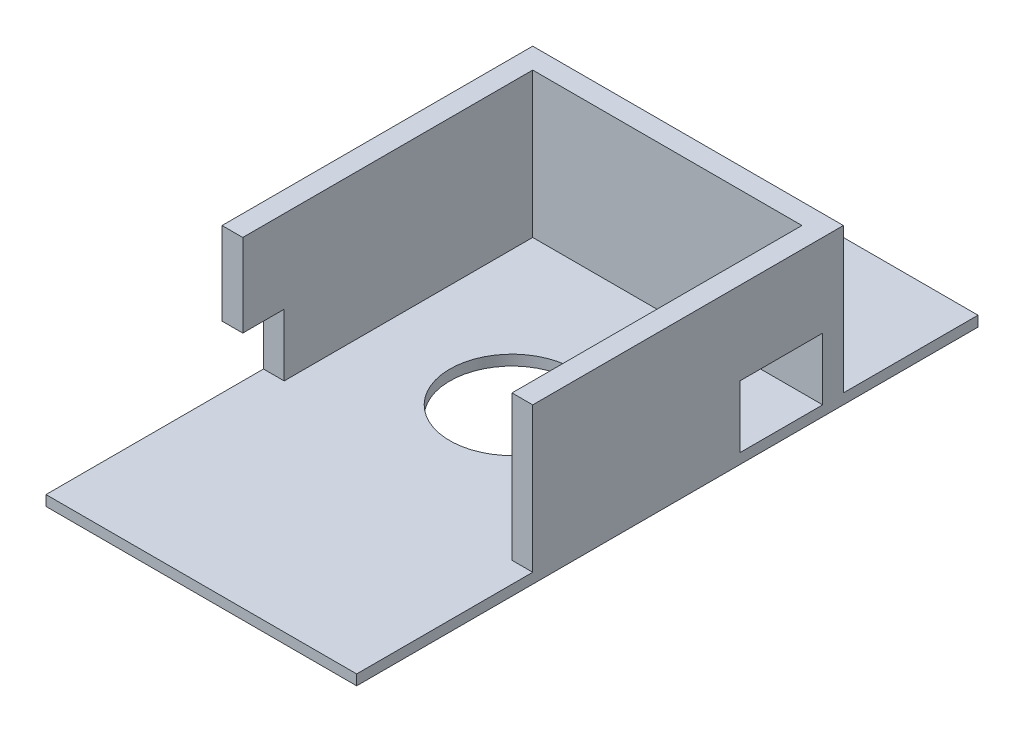
ISO-10303-21;
HEADER;
FILE_DESCRIPTION(('STEP AP214'),'2;1');
FILE_NAME('part.step','',(''),(''),'','','');
FILE_SCHEMA(('AUTOMOTIVE_DESIGN { 1 0 10303 214 1 1 1 1 }'));
ENDSEC;
DATA;
#1=APPLICATION_CONTEXT('core data for automotive mechanical design processes');
#2=APPLICATION_PROTOCOL_DEFINITION('international standard','automotive_design',2000,#1);
#3=PRODUCT_CONTEXT('',#1,'mechanical');
#4=PRODUCT('Part','Part','',(#3));
#5=PRODUCT_RELATED_PRODUCT_CATEGORY('part','',(#4));
#6=PRODUCT_DEFINITION_FORMATION('','',#4);
#7=PRODUCT_DEFINITION_CONTEXT('part definition',#1,'design');
#8=PRODUCT_DEFINITION('design','',#6,#7);
#9=PRODUCT_DEFINITION_SHAPE('','',#8);
#10=(LENGTH_UNIT() NAMED_UNIT(*) SI_UNIT(.MILLI.,.METRE.));
#11=(NAMED_UNIT(*) PLANE_ANGLE_UNIT() SI_UNIT($,.RADIAN.));
#12=(NAMED_UNIT(*) SI_UNIT($,.STERADIAN.) SOLID_ANGLE_UNIT());
#13=UNCERTAINTY_MEASURE_WITH_UNIT(LENGTH_MEASURE(1.E-05),#10,'distance_accuracy_value','');
#14=(GEOMETRIC_REPRESENTATION_CONTEXT(3) GLOBAL_UNCERTAINTY_ASSIGNED_CONTEXT((#13)) GLOBAL_UNIT_ASSIGNED_CONTEXT((#10,
#11,#12)) REPRESENTATION_CONTEXT('',''));
#15=CARTESIAN_POINT('',(0.,0.,0.));
#16=DIRECTION('',(0.,0.,1.));
#17=DIRECTION('',(1.,0.,0.));
#18=AXIS2_PLACEMENT_3D('',#15,#16,#17);
#19=CARTESIAN_POINT('',(0.,35.,0.));
#20=DIRECTION('',(0.,1.,0.));
#21=DIRECTION('',(0.,0.,1.));
#22=AXIS2_PLACEMENT_3D('',#19,#20,#21);
#23=PLANE('',#22);
#24=DIRECTION('',(0.,0.,1.));
#25=VECTOR('',#24,1.);
#26=CARTESIAN_POINT('',(-33.1781376518219,35.,-22.4898785425101));
#27=LINE('',#26,#25);
#28=CARTESIAN_POINT('',(-33.1781376518219,35.,-22.4898785425101));
#29=VERTEX_POINT('',#28);
#30=CARTESIAN_POINT('',(-33.1781376518219,35.,52.5101214574899));
#31=VERTEX_POINT('',#30);
#32=EDGE_CURVE('E319',#29,#31,#27,.T.);
#33=ORIENTED_EDGE('',*,*,#32,.T.);
#34=DIRECTION('',(-1.,0.,0.));
#35=VECTOR('',#34,1.);
#36=CARTESIAN_POINT('',(-33.1781376518219,35.,52.5101214574899));
#37=LINE('',#36,#35);
#38=CARTESIAN_POINT('',(-28.1781376518219,35.,52.5101214574899));
#39=VERTEX_POINT('',#38);
#40=EDGE_CURVE('E246',#39,#31,#37,.T.);
#41=ORIENTED_EDGE('',*,*,#40,.F.);
#42=DIRECTION('',(0.,0.,1.));
#43=VECTOR('',#42,1.);
#44=CARTESIAN_POINT('',(-28.1781376518219,35.,-17.4898785425101));
#45=LINE('',#44,#43);
#46=CARTESIAN_POINT('',(-28.1781376518219,35.,-17.4898785425101));
#47=VERTEX_POINT('',#46);
#48=EDGE_CURVE('E302',#47,#39,#45,.T.);
#49=ORIENTED_EDGE('',*,*,#48,.F.);
#50=DIRECTION('',(-1.,0.,0.));
#51=VECTOR('',#50,1.);
#52=CARTESIAN_POINT('',(-28.1781376518219,35.,-17.4898785425101));
#53=LINE('',#52,#51);
#54=CARTESIAN_POINT('',(36.8218623481781,35.,-17.4898785425101));
#55=VERTEX_POINT('',#54);
#56=EDGE_CURVE('E310',#55,#47,#53,.T.);
#57=ORIENTED_EDGE('',*,*,#56,.F.);
#58=DIRECTION('',(0.,0.,-1.));
#59=VECTOR('',#58,1.);
#60=CARTESIAN_POINT('',(36.8218623481781,35.,-17.4898785425101));
#61=LINE('',#60,#59);
#62=CARTESIAN_POINT('',(36.8218623481781,35.,52.5101214574899));
#63=VERTEX_POINT('',#62);
#64=EDGE_CURVE('E306',#63,#55,#61,.T.);
#65=ORIENTED_EDGE('',*,*,#64,.F.);
#66=CARTESIAN_POINT('',(41.8218623481781,35.,52.5101214574899));
#67=VERTEX_POINT('',#66);
#68=EDGE_CURVE('E247',#67,#63,#37,.T.);
#69=ORIENTED_EDGE('',*,*,#68,.F.);
#70=DIRECTION('',(0.,0.,-1.));
#71=VECTOR('',#70,1.);
#72=CARTESIAN_POINT('',(41.8218623481781,35.,-22.4898785425101));
#73=LINE('',#72,#71);
#74=CARTESIAN_POINT('',(41.8218623481781,35.,-22.4898785425101));
#75=VERTEX_POINT('',#74);
#76=EDGE_CURVE('E322',#67,#75,#73,.T.);
#77=ORIENTED_EDGE('',*,*,#76,.T.);
#78=DIRECTION('',(-1.,0.,0.));
#79=VECTOR('',#78,1.);
#80=CARTESIAN_POINT('',(-33.1781376518219,35.,-22.4898785425101));
#81=LINE('',#80,#79);
#82=EDGE_CURVE('E68',#75,#29,#81,.T.);
#83=ORIENTED_EDGE('',*,*,#82,.T.);
#84=EDGE_LOOP('',(#33,#41,#49,#57,#65,#69,#77,#83));
#85=FACE_BOUND('',#84,.T.);
#86=ADVANCED_FACE('F44',(#85),#23,.T.);
#87=CARTESIAN_POINT('',(-33.1781376518219,35.,-22.4898785425101));
#88=DIRECTION('',(1.,0.,0.));
#89=DIRECTION('',(0.,0.,-1.));
#90=AXIS2_PLACEMENT_3D('',#87,#88,#89);
#91=PLANE('',#90);
#92=DIRECTION('',(0.,0.,-1.));
#93=VECTOR('',#92,1.);
#94=CARTESIAN_POINT('',(-33.1781376518219,0.,95.0101214574899));
#95=LINE('',#94,#93);
#96=CARTESIAN_POINT('',(-33.1781376518219,0.,95.0101214574899));
#97=VERTEX_POINT('',#96);
#98=CARTESIAN_POINT('',(-33.1781376518219,0.,42.5101214574899));
#99=VERTEX_POINT('',#98);
#100=EDGE_CURVE('E273',#97,#99,#95,.T.);
#101=ORIENTED_EDGE('',*,*,#100,.T.);
#102=DIRECTION('',(0.,-1.,0.));
#103=VECTOR('',#102,1.);
#104=CARTESIAN_POINT('',(-33.1781376518219,0.,42.5101214574899));
#105=LINE('',#104,#103);
#106=CARTESIAN_POINT('',(-33.1781376518219,15.,42.5101214574899));
#107=VERTEX_POINT('',#106);
#108=EDGE_CURVE('E220',#107,#99,#105,.T.);
#109=ORIENTED_EDGE('',*,*,#108,.F.);
#110=DIRECTION('',(0.,0.,-1.));
#111=VECTOR('',#110,1.);
#112=CARTESIAN_POINT('',(-33.1781376518219,15.,62.5101214574899));
#113=LINE('',#112,#111);
#114=CARTESIAN_POINT('',(-33.1781376518219,15.,52.5101214574899));
#115=VERTEX_POINT('',#114);
#116=EDGE_CURVE('E216',#115,#107,#113,.T.);
#117=ORIENTED_EDGE('',*,*,#116,.F.);
#118=DIRECTION('',(0.,-1.,0.));
#119=VECTOR('',#118,1.);
#120=CARTESIAN_POINT('',(-33.1781376518219,35.,52.5101214574899));
#121=LINE('',#120,#119);
#122=EDGE_CURVE('E239',#31,#115,#121,.T.);
#123=ORIENTED_EDGE('',*,*,#122,.F.);
#124=ORIENTED_EDGE('',*,*,#32,.F.);
#125=DIRECTION('',(0.,-1.,0.));
#126=VECTOR('',#125,1.);
#127=CARTESIAN_POINT('',(-33.1781376518219,35.,-22.4898785425101));
#128=LINE('',#127,#126);
#129=CARTESIAN_POINT('',(-33.1781376518219,0.,-22.4898785425101));
#130=VERTEX_POINT('',#129);
#131=EDGE_CURVE('E327',#29,#130,#128,.T.);
#132=ORIENTED_EDGE('',*,*,#131,.T.);
#133=CARTESIAN_POINT('',(-33.1781376518218,0.,-54.9898785425101));
#134=VERTEX_POINT('',#133);
#135=EDGE_CURVE('E277',#130,#134,#95,.T.);
#136=ORIENTED_EDGE('',*,*,#135,.T.);
#137=DIRECTION('',(0.,1.,0.));
#138=VECTOR('',#137,1.);
#139=CARTESIAN_POINT('',(-33.1781376518218,-2.5,-54.9898785425101));
#140=LINE('',#139,#138);
#141=CARTESIAN_POINT('',(-33.1781376518218,-2.5,-54.9898785425101));
#142=VERTEX_POINT('',#141);
#143=EDGE_CURVE('E298',#142,#134,#140,.T.);
#144=ORIENTED_EDGE('',*,*,#143,.F.);
#145=DIRECTION('',(0.,0.,-1.));
#146=VECTOR('',#145,1.);
#147=CARTESIAN_POINT('',(-33.1781376518219,-2.5,95.0101214574899));
#148=LINE('',#147,#146);
#149=CARTESIAN_POINT('',(-33.1781376518219,-2.5,95.0101214574899));
#150=VERTEX_POINT('',#149);
#151=EDGE_CURVE('E258',#150,#142,#148,.T.);
#152=ORIENTED_EDGE('',*,*,#151,.F.);
#153=DIRECTION('',(0.,1.,0.));
#154=VECTOR('',#153,1.);
#155=CARTESIAN_POINT('',(-33.1781376518219,-2.5,95.0101214574899));
#156=LINE('',#155,#154);
#157=EDGE_CURVE('E272',#150,#97,#156,.T.);
#158=ORIENTED_EDGE('',*,*,#157,.T.);
#159=EDGE_LOOP('',(#101,#109,#117,#123,#124,#132,#136,#144,#152,#158));
#160=FACE_BOUND('',#159,.T.);
#161=ADVANCED_FACE('F46',(#160),#91,.F.);
#162=CARTESIAN_POINT('',(41.8218623481781,35.,-22.4898785425101));
#163=DIRECTION('',(-1.,0.,0.));
#164=DIRECTION('',(0.,0.,1.));
#165=AXIS2_PLACEMENT_3D('',#162,#163,#164);
#166=PLANE('',#165);
#167=DIRECTION('',(0.,0.,-1.));
#168=VECTOR('',#167,1.);
#169=CARTESIAN_POINT('',(41.8218623481781,0.,2.51012145748987));
#170=LINE('',#169,#168);
#171=CARTESIAN_POINT('',(41.8218623481781,0.,2.51012145748987));
#172=VERTEX_POINT('',#171);
#173=CARTESIAN_POINT('',(41.8218623481781,0.,-17.4898785425101));
#174=VERTEX_POINT('',#173);
#175=EDGE_CURVE('E182',#172,#174,#170,.T.);
#176=ORIENTED_EDGE('',*,*,#175,.F.);
#177=DIRECTION('',(0.,-1.,0.));
#178=VECTOR('',#177,1.);
#179=CARTESIAN_POINT('',(41.8218623481781,15.,2.51012145748988));
#180=LINE('',#179,#178);
#181=CARTESIAN_POINT('',(41.8218623481781,15.,2.51012145748988));
#182=VERTEX_POINT('',#181);
#183=EDGE_CURVE('E60',#182,#172,#180,.T.);
#184=ORIENTED_EDGE('',*,*,#183,.F.);
#185=DIRECTION('',(0.,0.,1.));
#186=VECTOR('',#185,1.);
#187=CARTESIAN_POINT('',(41.8218623481781,15.,2.51012145748988));
#188=LINE('',#187,#186);
#189=CARTESIAN_POINT('',(41.8218623481781,15.,-17.4898785425101));
#190=VERTEX_POINT('',#189);
#191=EDGE_CURVE('E193',#190,#182,#188,.T.);
#192=ORIENTED_EDGE('',*,*,#191,.F.);
#193=DIRECTION('',(0.,1.,0.));
#194=VECTOR('',#193,1.);
#195=CARTESIAN_POINT('',(41.8218623481781,15.,-17.4898785425101));
#196=LINE('',#195,#194);
#197=EDGE_CURVE('E170',#174,#190,#196,.T.);
#198=ORIENTED_EDGE('',*,*,#197,.F.);
#199=EDGE_LOOP('',(#176,#184,#192,#198));
#200=FACE_BOUND('',#199,.T.);
#201=DIRECTION('',(0.,1.,0.));
#202=VECTOR('',#201,1.);
#203=CARTESIAN_POINT('',(41.8218623481781,35.,52.5101214574899));
#204=LINE('',#203,#202);
#205=CARTESIAN_POINT('',(41.8218623481781,0.,52.5101214574899));
#206=VERTEX_POINT('',#205);
#207=EDGE_CURVE('E243',#206,#67,#204,.T.);
#208=ORIENTED_EDGE('',*,*,#207,.F.);
#209=DIRECTION('',(0.,0.,1.));
#210=VECTOR('',#209,1.);
#211=CARTESIAN_POINT('',(41.8218623481781,0.,95.0101214574899));
#212=LINE('',#211,#210);
#213=CARTESIAN_POINT('',(41.8218623481781,0.,95.0101214574899));
#214=VERTEX_POINT('',#213);
#215=EDGE_CURVE('E280',#206,#214,#212,.T.);
#216=ORIENTED_EDGE('',*,*,#215,.T.);
#217=DIRECTION('',(0.,1.,0.));
#218=VECTOR('',#217,1.);
#219=CARTESIAN_POINT('',(41.8218623481781,-2.5,95.0101214574899));
#220=LINE('',#219,#218);
#221=CARTESIAN_POINT('',(41.8218623481781,-2.5,95.0101214574899));
#222=VERTEX_POINT('',#221);
#223=EDGE_CURVE('E290',#222,#214,#220,.T.);
#224=ORIENTED_EDGE('',*,*,#223,.F.);
#225=DIRECTION('',(0.,0.,1.));
#226=VECTOR('',#225,1.);
#227=CARTESIAN_POINT('',(41.8218623481781,-2.5,95.0101214574899));
#228=LINE('',#227,#226);
#229=CARTESIAN_POINT('',(41.8218623481781,-2.5,-54.9898785425101));
#230=VERTEX_POINT('',#229);
#231=EDGE_CURVE('E266',#230,#222,#228,.T.);
#232=ORIENTED_EDGE('',*,*,#231,.F.);
#233=DIRECTION('',(0.,1.,0.));
#234=VECTOR('',#233,1.);
#235=CARTESIAN_POINT('',(41.8218623481781,-2.5,-54.9898785425101));
#236=LINE('',#235,#234);
#237=CARTESIAN_POINT('',(41.8218623481781,0.,-54.9898785425101));
#238=VERTEX_POINT('',#237);
#239=EDGE_CURVE('E294',#230,#238,#236,.T.);
#240=ORIENTED_EDGE('',*,*,#239,.T.);
#241=CARTESIAN_POINT('',(41.8218623481781,0.,-22.4898785425101));
#242=VERTEX_POINT('',#241);
#243=EDGE_CURVE('E281',#238,#242,#212,.T.);
#244=ORIENTED_EDGE('',*,*,#243,.T.);
#245=DIRECTION('',(0.,-1.,0.));
#246=VECTOR('',#245,1.);
#247=CARTESIAN_POINT('',(41.8218623481781,35.,-22.4898785425101));
#248=LINE('',#247,#246);
#249=EDGE_CURVE('E334',#75,#242,#248,.T.);
#250=ORIENTED_EDGE('',*,*,#249,.F.);
#251=ORIENTED_EDGE('',*,*,#76,.F.);
#252=EDGE_LOOP('',(#208,#216,#224,#232,#240,#244,#250,#251));
#253=FACE_BOUND('',#252,.T.);
#254=ADVANCED_FACE('F190',(#200,#253),#166,.F.);
#255=CARTESIAN_POINT('',(-33.1781376518219,35.,-22.4898785425101));
#256=DIRECTION('',(0.,0.,1.));
#257=DIRECTION('',(1.,0.,0.));
#258=AXIS2_PLACEMENT_3D('',#255,#256,#257);
#259=PLANE('',#258);
#260=DIRECTION('',(-1.,0.,0.));
#261=VECTOR('',#260,1.);
#262=CARTESIAN_POINT('',(-33.1781376518219,0.,-22.4898785425101));
#263=LINE('',#262,#261);
#264=EDGE_CURVE('E316',#242,#130,#263,.T.);
#265=ORIENTED_EDGE('',*,*,#264,.T.);
#266=ORIENTED_EDGE('',*,*,#131,.F.);
#267=ORIENTED_EDGE('',*,*,#82,.F.);
#268=ORIENTED_EDGE('',*,*,#249,.T.);
#269=EDGE_LOOP('',(#265,#266,#267,#268));
#270=FACE_BOUND('',#269,.T.);
#271=ADVANCED_FACE('F388',(#270),#259,.F.);
#272=CARTESIAN_POINT('',(-28.1781376518219,-5.,-17.4898785425101));
#273=DIRECTION('',(-1.,0.,0.));
#274=DIRECTION('',(0.,0.,1.));
#275=AXIS2_PLACEMENT_3D('',#272,#273,#274);
#276=PLANE('',#275);
#277=DIRECTION('',(0.,0.,-1.));
#278=VECTOR('',#277,1.);
#279=CARTESIAN_POINT('',(-28.1781376518219,15.,-17.4898785425101));
#280=LINE('',#279,#278);
#281=CARTESIAN_POINT('',(-28.1781376518219,15.,52.5101214574899));
#282=VERTEX_POINT('',#281);
#283=CARTESIAN_POINT('',(-28.1781376518219,15.,42.5101214574899));
#284=VERTEX_POINT('',#283);
#285=EDGE_CURVE('E229',#282,#284,#280,.T.);
#286=ORIENTED_EDGE('',*,*,#285,.T.);
#287=DIRECTION('',(0.,-1.,0.));
#288=VECTOR('',#287,1.);
#289=CARTESIAN_POINT('',(-28.1781376518219,-5.,42.5101214574899));
#290=LINE('',#289,#288);
#291=CARTESIAN_POINT('',(-28.1781376518219,0.,42.5101214574899));
#292=VERTEX_POINT('',#291);
#293=EDGE_CURVE('E235',#284,#292,#290,.T.);
#294=ORIENTED_EDGE('',*,*,#293,.T.);
#295=DIRECTION('',(0.,0.,1.));
#296=VECTOR('',#295,1.);
#297=CARTESIAN_POINT('',(-28.1781376518219,0.,0.));
#298=LINE('',#297,#296);
#299=CARTESIAN_POINT('',(-28.1781376518219,0.,-17.4898785425101));
#300=VERTEX_POINT('',#299);
#301=EDGE_CURVE('E178',#300,#292,#298,.T.);
#302=ORIENTED_EDGE('',*,*,#301,.F.);
#303=DIRECTION('',(0.,1.,0.));
#304=VECTOR('',#303,1.);
#305=CARTESIAN_POINT('',(-28.1781376518219,-5.,-17.4898785425101));
#306=LINE('',#305,#304);
#307=EDGE_CURVE('E173',#300,#47,#306,.T.);
#308=ORIENTED_EDGE('',*,*,#307,.T.);
#309=ORIENTED_EDGE('',*,*,#48,.T.);
#310=DIRECTION('',(0.,1.,0.));
#311=VECTOR('',#310,1.);
#312=CARTESIAN_POINT('',(-28.1781376518219,-5.,52.5101214574899));
#313=LINE('',#312,#311);
#314=EDGE_CURVE('E250',#282,#39,#313,.T.);
#315=ORIENTED_EDGE('',*,*,#314,.F.);
#316=EDGE_LOOP('',(#286,#294,#302,#308,#309,#315));
#317=FACE_BOUND('',#316,.T.);
#318=ADVANCED_FACE('F396',(#317),#276,.F.);
#319=CARTESIAN_POINT('',(-28.1781376518219,-5.,-17.4898785425101));
#320=DIRECTION('',(0.,0.,-1.));
#321=DIRECTION('',(-1.,0.,0.));
#322=AXIS2_PLACEMENT_3D('',#319,#320,#321);
#323=PLANE('',#322);
#324=DIRECTION('',(1.,0.,0.));
#325=VECTOR('',#324,1.);
#326=CARTESIAN_POINT('',(31.8218623481781,15.,-17.4898785425101));
#327=LINE('',#326,#325);
#328=CARTESIAN_POINT('',(36.8218623481781,15.,-17.4898785425101));
#329=VERTEX_POINT('',#328);
#330=EDGE_CURVE('E204',#329,#190,#327,.T.);
#331=ORIENTED_EDGE('',*,*,#330,.F.);
#332=DIRECTION('',(0.,1.,0.));
#333=VECTOR('',#332,1.);
#334=CARTESIAN_POINT('',(36.8218623481781,-5.,-17.4898785425101));
#335=LINE('',#334,#333);
#336=EDGE_CURVE('E313',#329,#55,#335,.T.);
#337=ORIENTED_EDGE('',*,*,#336,.T.);
#338=ORIENTED_EDGE('',*,*,#56,.T.);
#339=ORIENTED_EDGE('',*,*,#307,.F.);
#340=DIRECTION('',(-1.,0.,0.));
#341=VECTOR('',#340,1.);
#342=CARTESIAN_POINT('',(0.,0.,-17.4898785425101));
#343=LINE('',#342,#341);
#344=EDGE_CURVE('E165',#174,#300,#343,.T.);
#345=ORIENTED_EDGE('',*,*,#344,.F.);
#346=ORIENTED_EDGE('',*,*,#197,.T.);
#347=EDGE_LOOP('',(#331,#337,#338,#339,#345,#346));
#348=FACE_BOUND('',#347,.T.);
#349=ADVANCED_FACE('F168',(#348),#323,.F.);
#350=CARTESIAN_POINT('',(36.8218623481781,-5.,-17.4898785425101));
#351=DIRECTION('',(1.,0.,0.));
#352=DIRECTION('',(0.,0.,-1.));
#353=AXIS2_PLACEMENT_3D('',#350,#351,#352);
#354=PLANE('',#353);
#355=DIRECTION('',(0.,0.,1.));
#356=VECTOR('',#355,1.);
#357=CARTESIAN_POINT('',(36.8218623481781,15.,-17.4898785425101));
#358=LINE('',#357,#356);
#359=CARTESIAN_POINT('',(36.8218623481781,15.,2.51012145748988));
#360=VERTEX_POINT('',#359);
#361=EDGE_CURVE('E11',#329,#360,#358,.T.);
#362=ORIENTED_EDGE('',*,*,#361,.T.);
#363=DIRECTION('',(0.,-1.,0.));
#364=VECTOR('',#363,1.);
#365=CARTESIAN_POINT('',(36.8218623481781,-5.,2.51012145748987));
#366=LINE('',#365,#364);
#367=CARTESIAN_POINT('',(36.8218623481782,0.,2.51012145748987));
#368=VERTEX_POINT('',#367);
#369=EDGE_CURVE('E203',#360,#368,#366,.T.);
#370=ORIENTED_EDGE('',*,*,#369,.T.);
#371=DIRECTION('',(0.,0.,-1.));
#372=VECTOR('',#371,1.);
#373=CARTESIAN_POINT('',(36.8218623481781,0.,0.));
#374=LINE('',#373,#372);
#375=CARTESIAN_POINT('',(36.8218623481782,0.,52.5101214574899));
#376=VERTEX_POINT('',#375);
#377=EDGE_CURVE('E179',#376,#368,#374,.T.);
#378=ORIENTED_EDGE('',*,*,#377,.F.);
#379=DIRECTION('',(0.,-1.,0.));
#380=VECTOR('',#379,1.);
#381=CARTESIAN_POINT('',(36.8218623481782,-5.,52.5101214574899));
#382=LINE('',#381,#380);
#383=EDGE_CURVE('E342',#63,#376,#382,.T.);
#384=ORIENTED_EDGE('',*,*,#383,.F.);
#385=ORIENTED_EDGE('',*,*,#64,.T.);
#386=ORIENTED_EDGE('',*,*,#336,.F.);
#387=EDGE_LOOP('',(#362,#370,#378,#384,#385,#386));
#388=FACE_BOUND('',#387,.T.);
#389=ADVANCED_FACE('F423',(#388),#354,.F.);
#390=CARTESIAN_POINT('',(0.,-2.5,0.));
#391=DIRECTION('',(0.,-1.,0.));
#392=DIRECTION('',(0.,0.,-1.));
#393=AXIS2_PLACEMENT_3D('',#390,#391,#392);
#394=PLANE('',#393);
#395=CARTESIAN_POINT('',(4.32186234817812,-2.5,20.0101214574899));
#396=DIRECTION('',(0.,-1.,0.));
#397=DIRECTION('',(0.,0.,-1.));
#398=AXIS2_PLACEMENT_3D('',#395,#396,#397);
#399=CIRCLE('',#398,15.);
#400=CARTESIAN_POINT('',(4.32186234817812,-2.5,5.01012145748987));
#401=VERTEX_POINT('',#400);
#402=EDGE_CURVE('E253',#401,#401,#399,.T.);
#403=ORIENTED_EDGE('',*,*,#402,.F.);
#404=EDGE_LOOP('',(#403));
#405=FACE_BOUND('',#404,.T.);
#406=ORIENTED_EDGE('',*,*,#151,.T.);
#407=DIRECTION('',(1.,0.,0.));
#408=VECTOR('',#407,1.);
#409=CARTESIAN_POINT('',(-33.1781376518218,-2.5,-54.9898785425101));
#410=LINE('',#409,#408);
#411=EDGE_CURVE('E262',#142,#230,#410,.T.);
#412=ORIENTED_EDGE('',*,*,#411,.T.);
#413=ORIENTED_EDGE('',*,*,#231,.T.);
#414=DIRECTION('',(-1.,0.,0.));
#415=VECTOR('',#414,1.);
#416=CARTESIAN_POINT('',(-33.1781376518219,-2.5,95.0101214574899));
#417=LINE('',#416,#415);
#418=EDGE_CURVE('E269',#222,#150,#417,.T.);
#419=ORIENTED_EDGE('',*,*,#418,.T.);
#420=EDGE_LOOP('',(#406,#412,#413,#419));
#421=FACE_BOUND('',#420,.T.);
#422=ADVANCED_FACE('F379',(#405,#421),#394,.T.);
#423=CARTESIAN_POINT('',(-33.1781376518219,-2.5,95.0101214574899));
#424=DIRECTION('',(0.,0.,-1.));
#425=DIRECTION('',(-1.,0.,0.));
#426=AXIS2_PLACEMENT_3D('',#423,#424,#425);
#427=PLANE('',#426);
#428=DIRECTION('',(-1.,0.,0.));
#429=VECTOR('',#428,1.);
#430=CARTESIAN_POINT('',(-33.1781376518219,0.,95.0101214574899));
#431=LINE('',#430,#429);
#432=EDGE_CURVE('E263',#214,#97,#431,.T.);
#433=ORIENTED_EDGE('',*,*,#432,.T.);
#434=ORIENTED_EDGE('',*,*,#157,.F.);
#435=ORIENTED_EDGE('',*,*,#418,.F.);
#436=ORIENTED_EDGE('',*,*,#223,.T.);
#437=EDGE_LOOP('',(#433,#434,#435,#436));
#438=FACE_BOUND('',#437,.T.);
#439=ADVANCED_FACE('F373',(#438),#427,.F.);
#440=CARTESIAN_POINT('',(-33.1781376518218,-2.5,-54.9898785425101));
#441=DIRECTION('',(0.,0.,1.));
#442=DIRECTION('',(1.,0.,0.));
#443=AXIS2_PLACEMENT_3D('',#440,#441,#442);
#444=PLANE('',#443);
#445=DIRECTION('',(1.,0.,0.));
#446=VECTOR('',#445,1.);
#447=CARTESIAN_POINT('',(-33.1781376518218,0.,-54.9898785425101));
#448=LINE('',#447,#446);
#449=EDGE_CURVE('E276',#134,#238,#448,.T.);
#450=ORIENTED_EDGE('',*,*,#449,.T.);
#451=ORIENTED_EDGE('',*,*,#239,.F.);
#452=ORIENTED_EDGE('',*,*,#411,.F.);
#453=ORIENTED_EDGE('',*,*,#143,.T.);
#454=EDGE_LOOP('',(#450,#451,#452,#453));
#455=FACE_BOUND('',#454,.T.);
#456=ADVANCED_FACE('F445',(#455),#444,.F.);
#457=CARTESIAN_POINT('',(0.,0.,0.));
#458=DIRECTION('',(0.,-1.,0.));
#459=DIRECTION('',(0.,0.,-1.));
#460=AXIS2_PLACEMENT_3D('',#457,#458,#459);
#461=PLANE('',#460);
#462=ORIENTED_EDGE('',*,*,#264,.F.);
#463=ORIENTED_EDGE('',*,*,#243,.F.);
#464=ORIENTED_EDGE('',*,*,#449,.F.);
#465=ORIENTED_EDGE('',*,*,#135,.F.);
#466=EDGE_LOOP('',(#462,#463,#464,#465));
#467=FACE_BOUND('',#466,.T.);
#468=ADVANCED_FACE('F386',(#467),#461,.F.);
#469=ORIENTED_EDGE('',*,*,#377,.T.);
#470=DIRECTION('',(1.,0.,0.));
#471=VECTOR('',#470,1.);
#472=CARTESIAN_POINT('',(31.8218623481781,0.,2.51012145748987));
#473=LINE('',#472,#471);
#474=EDGE_CURVE('E186',#368,#172,#473,.T.);
#475=ORIENTED_EDGE('',*,*,#474,.T.);
#476=ORIENTED_EDGE('',*,*,#175,.T.);
#477=ORIENTED_EDGE('',*,*,#344,.T.);
#478=ORIENTED_EDGE('',*,*,#301,.T.);
#479=DIRECTION('',(-1.,0.,0.));
#480=VECTOR('',#479,1.);
#481=CARTESIAN_POINT('',(-23.1781376518219,0.,42.5101214574899));
#482=LINE('',#481,#480);
#483=EDGE_CURVE('E225',#292,#99,#482,.T.);
#484=ORIENTED_EDGE('',*,*,#483,.T.);
#485=ORIENTED_EDGE('',*,*,#100,.F.);
#486=ORIENTED_EDGE('',*,*,#432,.F.);
#487=ORIENTED_EDGE('',*,*,#215,.F.);
#488=DIRECTION('',(-1.,0.,0.));
#489=VECTOR('',#488,1.);
#490=CARTESIAN_POINT('',(41.8218623481781,0.,52.5101214574899));
#491=LINE('',#490,#489);
#492=EDGE_CURVE('E212',#206,#376,#491,.T.);
#493=ORIENTED_EDGE('',*,*,#492,.T.);
#494=EDGE_LOOP('',(#469,#475,#476,#477,#478,#484,#485,#486,#487,#493));
#495=FACE_BOUND('',#494,.T.);
#496=CARTESIAN_POINT('',(4.32186234817812,0.,20.0101214574899));
#497=DIRECTION('',(0.,-1.,0.));
#498=DIRECTION('',(0.,0.,-1.));
#499=AXIS2_PLACEMENT_3D('',#496,#497,#498);
#500=CIRCLE('',#499,15.);
#501=CARTESIAN_POINT('',(4.32186234817812,0.,5.01012145748987));
#502=VERTEX_POINT('',#501);
#503=EDGE_CURVE('E257',#502,#502,#500,.T.);
#504=ORIENTED_EDGE('',*,*,#503,.T.);
#505=EDGE_LOOP('',(#504));
#506=FACE_BOUND('',#505,.T.);
#507=ADVANCED_FACE('F184',(#495,#506),#461,.F.);
#508=CARTESIAN_POINT('',(4.32186234817812,12.5,20.0101214574899));
#509=DIRECTION('',(0.,-1.,0.));
#510=DIRECTION('',(0.,0.,-1.));
#511=AXIS2_PLACEMENT_3D('',#508,#509,#510);
#512=CYLINDRICAL_SURFACE('',#511,15.);
#513=ORIENTED_EDGE('',*,*,#402,.T.);
#514=EDGE_LOOP('',(#513));
#515=FACE_BOUND('',#514,.T.);
#516=ORIENTED_EDGE('',*,*,#503,.F.);
#517=EDGE_LOOP('',(#516));
#518=FACE_BOUND('',#517,.T.);
#519=ADVANCED_FACE('F462',(#515,#518),#512,.F.);
#520=CARTESIAN_POINT('',(0.,0.,52.5101214574899));
#521=DIRECTION('',(0.,0.,1.));
#522=DIRECTION('',(1.,0.,0.));
#523=AXIS2_PLACEMENT_3D('',#520,#521,#522);
#524=PLANE('',#523);
#525=DIRECTION('',(-1.,0.,0.));
#526=VECTOR('',#525,1.);
#527=CARTESIAN_POINT('',(0.,15.,52.5101214574899));
#528=LINE('',#527,#526);
#529=EDGE_CURVE('E53',#282,#115,#528,.T.);
#530=ORIENTED_EDGE('',*,*,#529,.F.);
#531=ORIENTED_EDGE('',*,*,#314,.T.);
#532=ORIENTED_EDGE('',*,*,#40,.T.);
#533=ORIENTED_EDGE('',*,*,#122,.T.);
#534=EDGE_LOOP('',(#530,#531,#532,#533));
#535=FACE_BOUND('',#534,.T.);
#536=ADVANCED_FACE('F359',(#535),#524,.T.);
#537=ORIENTED_EDGE('',*,*,#383,.T.);
#538=ORIENTED_EDGE('',*,*,#492,.F.);
#539=ORIENTED_EDGE('',*,*,#207,.T.);
#540=ORIENTED_EDGE('',*,*,#68,.T.);
#541=EDGE_LOOP('',(#537,#538,#539,#540));
#542=FACE_BOUND('',#541,.T.);
#543=ADVANCED_FACE('F475',(#542),#524,.T.);
#544=CARTESIAN_POINT('',(-23.1781376518219,0.,42.5101214574899));
#545=DIRECTION('',(0.,0.,-1.));
#546=DIRECTION('',(-1.,0.,0.));
#547=AXIS2_PLACEMENT_3D('',#544,#545,#546);
#548=PLANE('',#547);
#549=DIRECTION('',(-1.,0.,0.));
#550=VECTOR('',#549,1.);
#551=CARTESIAN_POINT('',(-23.1781376518219,15.,42.5101214574899));
#552=LINE('',#551,#550);
#553=EDGE_CURVE('E224',#284,#107,#552,.T.);
#554=ORIENTED_EDGE('',*,*,#553,.T.);
#555=ORIENTED_EDGE('',*,*,#108,.T.);
#556=ORIENTED_EDGE('',*,*,#483,.F.);
#557=ORIENTED_EDGE('',*,*,#293,.F.);
#558=EDGE_LOOP('',(#554,#555,#556,#557));
#559=FACE_BOUND('',#558,.T.);
#560=ADVANCED_FACE('F482',(#559),#548,.F.);
#561=CARTESIAN_POINT('',(-23.1781376518219,15.,62.5101214574899));
#562=DIRECTION('',(0.,1.,0.));
#563=DIRECTION('',(0.,0.,1.));
#564=AXIS2_PLACEMENT_3D('',#561,#562,#563);
#565=PLANE('',#564);
#566=ORIENTED_EDGE('',*,*,#529,.T.);
#567=ORIENTED_EDGE('',*,*,#116,.T.);
#568=ORIENTED_EDGE('',*,*,#553,.F.);
#569=ORIENTED_EDGE('',*,*,#285,.F.);
#570=EDGE_LOOP('',(#566,#567,#568,#569));
#571=FACE_BOUND('',#570,.T.);
#572=ADVANCED_FACE('F351',(#571),#565,.F.);
#573=CARTESIAN_POINT('',(31.8218623481781,15.,2.51012145748988));
#574=DIRECTION('',(0.,1.,0.));
#575=DIRECTION('',(0.,0.,1.));
#576=AXIS2_PLACEMENT_3D('',#573,#574,#575);
#577=PLANE('',#576);
#578=ORIENTED_EDGE('',*,*,#330,.T.);
#579=ORIENTED_EDGE('',*,*,#191,.T.);
#580=DIRECTION('',(1.,0.,0.));
#581=VECTOR('',#580,1.);
#582=CARTESIAN_POINT('',(31.8218623481781,15.,2.51012145748988));
#583=LINE('',#582,#581);
#584=EDGE_CURVE('E200',#360,#182,#583,.T.);
#585=ORIENTED_EDGE('',*,*,#584,.F.);
#586=ORIENTED_EDGE('',*,*,#361,.F.);
#587=EDGE_LOOP('',(#578,#579,#585,#586));
#588=FACE_BOUND('',#587,.T.);
#589=ADVANCED_FACE('F495',(#588),#577,.F.);
#590=CARTESIAN_POINT('',(31.8218623481781,15.,2.51012145748988));
#591=DIRECTION('',(0.,0.,1.));
#592=DIRECTION('',(0.,-1.,0.));
#593=AXIS2_PLACEMENT_3D('',#590,#591,#592);
#594=PLANE('',#593);
#595=ORIENTED_EDGE('',*,*,#584,.T.);
#596=ORIENTED_EDGE('',*,*,#183,.T.);
#597=ORIENTED_EDGE('',*,*,#474,.F.);
#598=ORIENTED_EDGE('',*,*,#369,.F.);
#599=EDGE_LOOP('',(#595,#596,#597,#598));
#600=FACE_BOUND('',#599,.T.);
#601=ADVANCED_FACE('F501',(#600),#594,.F.);
#602=CLOSED_SHELL('',(#86,#161,#254,#271,#318,#349,#389,#422,#439,#456,#468,#507,#519,#536,#543,
#560,#572,#589,#601));
#603=MANIFOLD_SOLID_BREP('B2',#602);
#604=ADVANCED_BREP_SHAPE_REPRESENTATION('',(#18,#603),#14);
#605=SHAPE_DEFINITION_REPRESENTATION(#9,#604);
ENDSEC;
END-ISO-10303-21;
